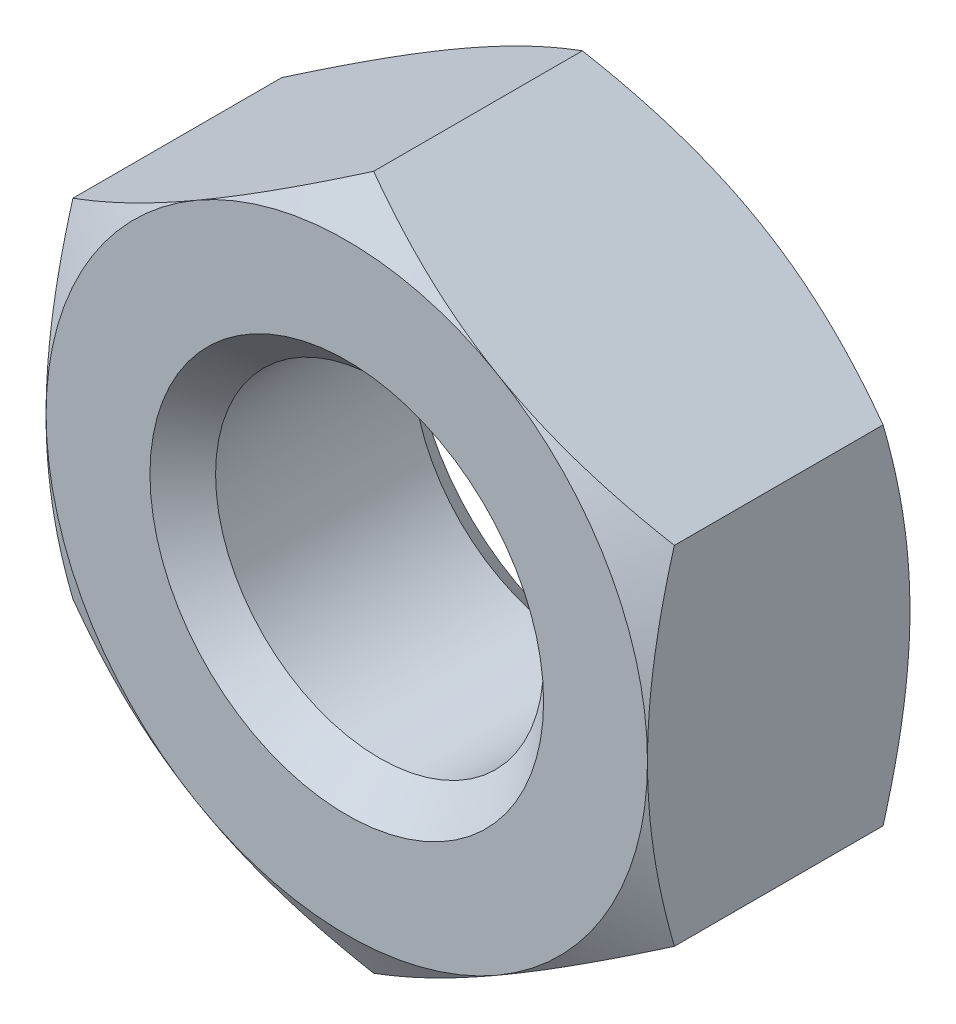
ISO-10303-21;
HEADER;
FILE_DESCRIPTION(('STEP AP214'),'2;1');
FILE_NAME('part.step','',(''),(''),'','','');
FILE_SCHEMA(('AUTOMOTIVE_DESIGN { 1 0 10303 214 1 1 1 1 }'));
ENDSEC;
DATA;
#1=APPLICATION_CONTEXT('core data for automotive mechanical design processes');
#2=APPLICATION_PROTOCOL_DEFINITION('international standard','automotive_design',2000,#1);
#3=PRODUCT_CONTEXT('',#1,'mechanical');
#4=PRODUCT('Part','Part','',(#3));
#5=PRODUCT_RELATED_PRODUCT_CATEGORY('part','',(#4));
#6=PRODUCT_DEFINITION_FORMATION('','',#4);
#7=PRODUCT_DEFINITION_CONTEXT('part definition',#1,'design');
#8=PRODUCT_DEFINITION('design','',#6,#7);
#9=PRODUCT_DEFINITION_SHAPE('','',#8);
#10=(LENGTH_UNIT() NAMED_UNIT(*) SI_UNIT(.MILLI.,.METRE.));
#11=(NAMED_UNIT(*) PLANE_ANGLE_UNIT() SI_UNIT($,.RADIAN.));
#12=(NAMED_UNIT(*) SI_UNIT($,.STERADIAN.) SOLID_ANGLE_UNIT());
#13=UNCERTAINTY_MEASURE_WITH_UNIT(LENGTH_MEASURE(1.E-05),#10,'distance_accuracy_value','');
#14=(GEOMETRIC_REPRESENTATION_CONTEXT(3) GLOBAL_UNCERTAINTY_ASSIGNED_CONTEXT((#13)) GLOBAL_UNIT_ASSIGNED_CONTEXT((#10,
#11,#12)) REPRESENTATION_CONTEXT('',''));
#15=CARTESIAN_POINT('',(0.,0.,0.));
#16=DIRECTION('',(0.,0.,1.));
#17=DIRECTION('',(1.,0.,0.));
#18=AXIS2_PLACEMENT_3D('',#15,#16,#17);
#19=CARTESIAN_POINT('',(0.,0.,2.4));
#20=DIRECTION('',(0.,0.,-1.));
#21=DIRECTION('',(-1.,0.,0.));
#22=AXIS2_PLACEMENT_3D('',#19,#20,#21);
#23=CONICAL_SURFACE('',#22,2.74999999999999,1.0471975511966);
#24=CARTESIAN_POINT('',(-0.000200000000000651,3.17554195059678,2.15431323663524));
#25=CARTESIAN_POINT('',(0.120649220659905,3.10576962051743,2.19461233775073));
#26=CARTESIAN_POINT('',(0.242541602622633,3.03539502097908,2.23126309740233));
#27=CARTESIAN_POINT('',(0.488437126727893,2.89342717394439,2.2952378170302));
#28=CARTESIAN_POINT('',(0.612444638573856,2.82183140359858,2.3225391443255));
#29=CARTESIAN_POINT('',(0.858922797975944,2.67952717191843,2.36503825470588));
#30=CARTESIAN_POINT('',(0.981355518587418,2.60884060771577,2.38051888137754));
#31=CARTESIAN_POINT('',(1.22679714236892,2.46713482015519,2.39900060263006));
#32=CARTESIAN_POINT('',(1.34980515323291,2.39611611197038,2.4020170005374));
#33=CARTESIAN_POINT('',(1.57965878661079,2.26341005486544,2.39574685457145));
#34=CARTESIAN_POINT('',(1.68653879125402,2.20170285541369,2.38799984572329));
#35=CARTESIAN_POINT('',(1.89960246733475,2.07869048467395,2.36344481893564));
#36=CARTESIAN_POINT('',(2.00578540164889,2.01738573896434,2.34662841034943));
#37=CARTESIAN_POINT('',(2.21928848939318,1.89411967378235,2.30458807765404));
#38=CARTESIAN_POINT('',(2.32658161614285,1.83217395817123,2.27918591931277));
#39=CARTESIAN_POINT('',(2.53956747928405,1.70920651275308,2.22153277416001));
#40=CARTESIAN_POINT('',(2.64526294502665,1.64818320715446,2.18929533670101));
#41=CARTESIAN_POINT('',(2.7502,1.58759777021764,2.15431323663524));
#42=B_SPLINE_CURVE_WITH_KNOTS('',3,(#24,#25,#26,#27,#28,#29,#30,#31,#32,#33,#34,#35,#36,#37,#38,
#39,#40,#41),.UNSPECIFIED.,.F.,.F.,(4,2,2,2,2,2,2,2,4),(0.,0.435912828725888,0.872873557116333,
1.29901931904672,1.72464171213574,2.09526089052938,2.46622354066374,2.84541551798557,
3.22386274754524),.UNSPECIFIED.);
#43=CARTESIAN_POINT('',(0.,3.17542648054294,2.15437990693813));
#44=VERTEX_POINT('',#43);
#45=CARTESIAN_POINT('',(1.375,2.38156986040721,2.4));
#46=VERTEX_POINT('',#45);
#47=EDGE_CURVE('E291',#44,#46,#42,.T.);
#48=ORIENTED_EDGE('',*,*,#47,.F.);
#49=CARTESIAN_POINT('',(-2.7502,1.58759777021763,2.15431323663524));
#50=CARTESIAN_POINT('',(-2.62935077934009,1.65737010029699,2.19461233775073));
#51=CARTESIAN_POINT('',(-2.50745839737737,1.72774469983533,2.23126309740234));
#52=CARTESIAN_POINT('',(-2.26156287327211,1.86971254687003,2.2952378170302));
#53=CARTESIAN_POINT('',(-2.13755536142615,1.94130831721583,2.3225391443255));
#54=CARTESIAN_POINT('',(-1.89107720202406,2.08361254889599,2.36503825470588));
#55=CARTESIAN_POINT('',(-1.76864448141258,2.15429911309864,2.38051888137754));
#56=CARTESIAN_POINT('',(-1.52320285763108,2.29600490065923,2.39900060263006));
#57=CARTESIAN_POINT('',(-1.40019484676709,2.36702360884404,2.4020170005374));
#58=CARTESIAN_POINT('',(-1.17034121338921,2.49972966594897,2.39574685457145));
#59=CARTESIAN_POINT('',(-1.06346120874598,2.56143686540073,2.38799984572329));
#60=CARTESIAN_POINT('',(-0.85039753266525,2.68444923614047,2.36344481893564));
#61=CARTESIAN_POINT('',(-0.744214598351111,2.74575398185008,2.34662841034943));
#62=CARTESIAN_POINT('',(-0.530711510606816,2.86902004703206,2.30458807765404));
#63=CARTESIAN_POINT('',(-0.423418383857145,2.93096576264318,2.27918591931277));
#64=CARTESIAN_POINT('',(-0.210432520715949,3.05393320806134,2.22153277416002));
#65=CARTESIAN_POINT('',(-0.104737054973348,3.11495651365995,2.18929533670101));
#66=CARTESIAN_POINT('',(0.000199999999999467,3.17554195059678,2.15431323663524));
#67=B_SPLINE_CURVE_WITH_KNOTS('',3,(#49,#50,#51,#52,#53,#54,#55,#56,#57,#58,#59,#60,#61,#62,#63,
#64,#65,#66),.UNSPECIFIED.,.F.,.F.,(4,2,2,2,2,2,2,2,4),(0.,0.435912828725888,0.872873557116332,
1.29901931904672,1.72464171213574,2.09526089052938,2.46622354066374,2.84541551798557,
3.22386274754524),.UNSPECIFIED.);
#68=CARTESIAN_POINT('',(-1.375,2.3815698604072,2.4));
#69=VERTEX_POINT('',#68);
#70=EDGE_CURVE('E186',#69,#44,#67,.T.);
#71=ORIENTED_EDGE('',*,*,#70,.F.);
#72=CARTESIAN_POINT('',(0.,0.,2.4));
#73=DIRECTION('',(0.,0.,1.));
#74=DIRECTION('',(1.,0.,0.));
#75=AXIS2_PLACEMENT_3D('',#72,#73,#74);
#76=CIRCLE('',#75,2.74999999999999);
#77=EDGE_CURVE('E294',#46,#69,#76,.T.);
#78=ORIENTED_EDGE('',*,*,#77,.F.);
#79=EDGE_LOOP('',(#48,#71,#78));
#80=FACE_BOUND('',#79,.T.);
#81=ADVANCED_FACE('F35',(#80),#23,.T.);
#82=CARTESIAN_POINT('',(2.75,1.58771324027147,2.15437990693813));
#83=VERTEX_POINT('',#82);
#84=EDGE_CURVE('E229',#46,#83,#42,.T.);
#85=ORIENTED_EDGE('',*,*,#84,.F.);
#86=CARTESIAN_POINT('',(2.75,0.,2.4));
#87=VERTEX_POINT('',#86);
#88=EDGE_CURVE('E151',#87,#46,#76,.T.);
#89=ORIENTED_EDGE('',*,*,#88,.F.);
#90=CARTESIAN_POINT('',(2.75,-4.25703551985585,1.06168912227367));
#91=CARTESIAN_POINT('',(2.75,-4.13699202015188,1.1198897518569));
#92=CARTESIAN_POINT('',(2.75,-4.01667212109087,1.17753009028097));
#93=CARTESIAN_POINT('',(2.75,-3.77533251301454,1.29137491748593));
#94=CARTESIAN_POINT('',(2.75,-3.65431269665322,1.34757917844764));
#95=CARTESIAN_POINT('',(2.75,-3.41079896235313,1.45852101631478));
#96=CARTESIAN_POINT('',(2.75,-3.28830060104036,1.51324887399081));
#97=CARTESIAN_POINT('',(2.75,-3.0423268737957,1.6204546272455));
#98=CARTESIAN_POINT('',(2.75,-2.91885155457909,1.67293262964465));
#99=CARTESIAN_POINT('',(2.75,-2.6667672834933,1.77667422753005));
#100=CARTESIAN_POINT('',(2.75,-2.53812020933303,1.827845696476));
#101=CARTESIAN_POINT('',(2.75,-2.27931806738651,1.92629695293699));
#102=CARTESIAN_POINT('',(2.75,-2.14916283179932,1.97357630257118));
#103=CARTESIAN_POINT('',(2.75,-1.88738349367343,2.06299644494595));
#104=CARTESIAN_POINT('',(2.75,-1.75576300415808,2.10514770824627));
#105=CARTESIAN_POINT('',(2.75,-1.49063398759824,2.18295393254175));
#106=CARTESIAN_POINT('',(2.75,-1.35712607210049,2.21861094801352));
#107=CARTESIAN_POINT('',(2.75,-1.08888872336787,2.28152236978619));
#108=CARTESIAN_POINT('',(2.75,-0.954170144262174,2.30882220058641));
#109=CARTESIAN_POINT('',(2.75,-0.683065665460635,2.35347177013791));
#110=CARTESIAN_POINT('',(2.75,-0.546679921873346,2.3708224333215));
#111=CARTESIAN_POINT('',(2.75,-0.274700449305351,2.39396226102916));
#112=CARTESIAN_POINT('',(2.75,-0.139119628156501,2.39989941561687));
#113=CARTESIAN_POINT('',(2.75,0.132061490225183,2.40009796962967));
#114=CARTESIAN_POINT('',(2.75,0.267661787790451,2.39435913790454));
#115=CARTESIAN_POINT('',(2.75,0.498103730594134,2.37508940850493));
#116=CARTESIAN_POINT('',(2.75,0.593192954043431,2.3643496320825));
#117=CARTESIAN_POINT('',(2.75,0.782667924753957,2.33780156933777));
#118=CARTESIAN_POINT('',(2.75,0.877053573597802,2.32199258705082));
#119=CARTESIAN_POINT('',(2.75,1.1590214506406,2.26779109356569));
#120=CARTESIAN_POINT('',(2.75,1.34530708104592,2.22263420881916));
#121=CARTESIAN_POINT('',(2.75,1.71809932057939,2.11803227199905));
#122=CARTESIAN_POINT('',(2.75,1.9045206274722,2.05829473382884));
#123=CARTESIAN_POINT('',(2.75,2.18156676107034,1.96151978056661));
#124=CARTESIAN_POINT('',(2.75,2.27347486824372,1.92807062515835));
#125=CARTESIAN_POINT('',(2.75,2.45653326427404,1.85915907022219));
#126=CARTESIAN_POINT('',(2.75,2.547683561196,1.82369669215161));
#127=CARTESIAN_POINT('',(2.75,2.75939154686356,1.73907482926415));
#128=CARTESIAN_POINT('',(2.75,2.87969007423819,1.68926894777099));
#129=CARTESIAN_POINT('',(2.75,3.1192872521915,1.58730203505826));
#130=CARTESIAN_POINT('',(2.75,3.23858584929597,1.53514087882425));
#131=CARTESIAN_POINT('',(2.75,3.59527333595667,1.3758406288591));
#132=CARTESIAN_POINT('',(2.75,3.83141053240481,1.26590252071369));
#133=CARTESIAN_POINT('',(2.75,4.30155519589416,1.04103998359695));
#134=CARTESIAN_POINT('',(2.75,4.53556037022231,0.926110812679219));
#135=CARTESIAN_POINT('',(2.75,5.00188861456581,0.692877117459767));
#136=CARTESIAN_POINT('',(2.75,5.23421162460997,0.574572473553994));
#137=CARTESIAN_POINT('',(2.75,5.67871269594213,0.34531625854499));
#138=CARTESIAN_POINT('',(2.75,5.89098784504084,0.234552282947296));
#139=CARTESIAN_POINT('',(2.75,6.31474198142339,0.0114964607474494));
#140=CARTESIAN_POINT('',(2.75,6.52622094212367,-0.100795436302165));
#141=CARTESIAN_POINT('',(2.75,6.94804906666101,-0.32627676551508));
#142=CARTESIAN_POINT('',(2.75,7.15839972281913,-0.439463409992933));
#143=CARTESIAN_POINT('',(2.75,7.57858974341547,-0.666755674620288));
#144=CARTESIAN_POINT('',(2.75,7.78842913439936,-0.780861245673605));
#145=CARTESIAN_POINT('',(2.75,7.9980793794217,-0.895310882801251));
#146=B_SPLINE_CURVE_WITH_KNOTS('',3,(#90,#91,#92,#93,#94,#95,#96,#97,#98,#99,#100,#101,#102,
#103,#104,#105,#106,#107,#108,#109,#110,#111,#112,#113,#114,#115,#116,#117,#118,#119,#120,#121,
#122,#123,#124,#125,#126,#127,#128,#129,#130,#131,#132,#133,#134,#135,#136,#137,#138,#139,#140,
#141,#142,#143,#144,#145),.UNSPECIFIED.,.F.,.F.,(4,2,2,2,2,2,2,2,2,2,2,2,2,2,2,2,2,2,2,2,2,2,2,
2,2,2,2,4),(0.,0.400229610241993,0.800522323538853,1.20300748075733,1.60547350724249,
2.02077686084746,2.4361268742646,2.85061405973589,3.26496989220291,3.67703182770082,
4.08905547003323,4.49569970512682,4.90235199066004,5.18929513742869,5.47627769625907,
6.05056533161353,6.63748740454623,6.93088606817702,7.22428160529455,7.61485258544412,
8.00544432094012,8.7867683742183,9.568851728826,10.3509628297038,11.0692623230148,
11.7875855902848,12.5041914870438,13.2207593478582),.UNSPECIFIED.);
#147=EDGE_CURVE('E227',#83,#87,#146,.F.);
#148=ORIENTED_EDGE('',*,*,#147,.F.);
#149=EDGE_LOOP('',(#85,#89,#148));
#150=FACE_BOUND('',#149,.T.);
#151=ADVANCED_FACE('F282',(#150),#23,.T.);
#152=CARTESIAN_POINT('',(2.75,-1.58771324027147,2.15437990693813));
#153=VERTEX_POINT('',#152);
#154=EDGE_CURVE('E222',#87,#153,#146,.F.);
#155=ORIENTED_EDGE('',*,*,#154,.F.);
#156=CARTESIAN_POINT('',(1.375,-2.38156986040721,2.4));
#157=VERTEX_POINT('',#156);
#158=EDGE_CURVE('E297',#157,#87,#76,.T.);
#159=ORIENTED_EDGE('',*,*,#158,.F.);
#160=CARTESIAN_POINT('',(2.7502,-1.58759777021763,2.15431323663524));
#161=CARTESIAN_POINT('',(2.62935077934009,-1.65737010029699,2.19461233775073));
#162=CARTESIAN_POINT('',(2.50745839737737,-1.72774469983533,2.23126309740234));
#163=CARTESIAN_POINT('',(2.26156287327211,-1.86971254687003,2.2952378170302));
#164=CARTESIAN_POINT('',(2.13755536142615,-1.94130831721583,2.3225391443255));
#165=CARTESIAN_POINT('',(1.89107720202406,-2.08361254889599,2.36503825470588));
#166=CARTESIAN_POINT('',(1.76864448141258,-2.15429911309864,2.38051888137754));
#167=CARTESIAN_POINT('',(1.52320285763108,-2.29600490065923,2.39900060263006));
#168=CARTESIAN_POINT('',(1.40019484676709,-2.36702360884404,2.4020170005374));
#169=CARTESIAN_POINT('',(1.17034121338921,-2.49972966594897,2.39574685457145));
#170=CARTESIAN_POINT('',(1.06346120874598,-2.56143686540073,2.38799984572329));
#171=CARTESIAN_POINT('',(0.85039753266525,-2.68444923614047,2.36344481893564));
#172=CARTESIAN_POINT('',(0.744214598351111,-2.74575398185008,2.34662841034943));
#173=CARTESIAN_POINT('',(0.530711510606816,-2.86902004703206,2.30458807765404));
#174=CARTESIAN_POINT('',(0.423418383857145,-2.93096576264318,2.27918591931277));
#175=CARTESIAN_POINT('',(0.210432520715948,-3.05393320806134,2.22153277416002));
#176=CARTESIAN_POINT('',(0.104737054973347,-3.11495651365995,2.18929533670101));
#177=CARTESIAN_POINT('',(-0.000200000000000172,-3.17554195059678,2.15431323663524));
#178=B_SPLINE_CURVE_WITH_KNOTS('',3,(#160,#161,#162,#163,#164,#165,#166,#167,#168,#169,#170,
#171,#172,#173,#174,#175,#176,#177),.UNSPECIFIED.,.F.,.F.,(4,2,2,2,2,2,2,2,4),(0.,
0.435912828725888,0.872873557116332,1.29901931904672,1.72464171213574,2.09526089052938,
2.46622354066374,2.84541551798557,3.22386274754524),.UNSPECIFIED.);
#179=EDGE_CURVE('E228',#153,#157,#178,.T.);
#180=ORIENTED_EDGE('',*,*,#179,.F.);
#181=EDGE_LOOP('',(#155,#159,#180));
#182=FACE_BOUND('',#181,.T.);
#183=ADVANCED_FACE('F287',(#182),#23,.T.);
#184=CARTESIAN_POINT('',(0.,-3.17542648054294,2.15437990693813));
#185=VERTEX_POINT('',#184);
#186=EDGE_CURVE('E216',#157,#185,#178,.T.);
#187=ORIENTED_EDGE('',*,*,#186,.F.);
#188=CARTESIAN_POINT('',(-1.375,-2.38156986040721,2.4));
#189=VERTEX_POINT('',#188);
#190=EDGE_CURVE('E299',#189,#157,#76,.T.);
#191=ORIENTED_EDGE('',*,*,#190,.F.);
#192=CARTESIAN_POINT('',(0.0002,-3.17554195059678,2.15431323663524));
#193=CARTESIAN_POINT('',(-0.120649220659906,-3.10576962051743,2.19461233775073));
#194=CARTESIAN_POINT('',(-0.242541602622634,-3.03539502097908,2.23126309740233));
#195=CARTESIAN_POINT('',(-0.488437126727893,-2.89342717394439,2.2952378170302));
#196=CARTESIAN_POINT('',(-0.612444638573856,-2.82183140359858,2.3225391443255));
#197=CARTESIAN_POINT('',(-0.858922797975945,-2.67952717191843,2.36503825470588));
#198=CARTESIAN_POINT('',(-0.981355518587418,-2.60884060771577,2.38051888137754));
#199=CARTESIAN_POINT('',(-1.22679714236892,-2.46713482015519,2.39900060263006));
#200=CARTESIAN_POINT('',(-1.34980515323291,-2.39611611197038,2.4020170005374));
#201=CARTESIAN_POINT('',(-1.57965878661079,-2.26341005486544,2.39574685457145));
#202=CARTESIAN_POINT('',(-1.68653879125402,-2.20170285541369,2.38799984572329));
#203=CARTESIAN_POINT('',(-1.89960246733475,-2.07869048467395,2.36344481893564));
#204=CARTESIAN_POINT('',(-2.00578540164889,-2.01738573896434,2.34662841034943));
#205=CARTESIAN_POINT('',(-2.21928848939318,-1.89411967378235,2.30458807765404));
#206=CARTESIAN_POINT('',(-2.32658161614285,-1.83217395817123,2.27918591931277));
#207=CARTESIAN_POINT('',(-2.53956747928405,-1.70920651275308,2.22153277416002));
#208=CARTESIAN_POINT('',(-2.64526294502665,-1.64818320715446,2.18929533670101));
#209=CARTESIAN_POINT('',(-2.7502,-1.58759777021763,2.15431323663524));
#210=B_SPLINE_CURVE_WITH_KNOTS('',3,(#192,#193,#194,#195,#196,#197,#198,#199,#200,#201,#202,
#203,#204,#205,#206,#207,#208,#209),.UNSPECIFIED.,.F.,.F.,(4,2,2,2,2,2,2,2,4),(0.,
0.435912828725889,0.872873557116333,1.29901931904672,1.72464171213574,2.09526089052938,
2.46622354066374,2.84541551798557,3.22386274754524),.UNSPECIFIED.);
#211=EDGE_CURVE('E323',#185,#189,#210,.T.);
#212=ORIENTED_EDGE('',*,*,#211,.F.);
#213=EDGE_LOOP('',(#187,#191,#212));
#214=FACE_BOUND('',#213,.T.);
#215=ADVANCED_FACE('F327',(#214),#23,.T.);
#216=CARTESIAN_POINT('',(-2.75,-1.58771324027147,2.15437990693813));
#217=VERTEX_POINT('',#216);
#218=EDGE_CURVE('E211',#189,#217,#210,.T.);
#219=ORIENTED_EDGE('',*,*,#218,.F.);
#220=CARTESIAN_POINT('',(-2.75,0.,2.4));
#221=VERTEX_POINT('',#220);
#222=EDGE_CURVE('E314',#221,#189,#76,.T.);
#223=ORIENTED_EDGE('',*,*,#222,.F.);
#224=CARTESIAN_POINT('',(-2.75,-4.25703551985585,1.06168912227367));
#225=CARTESIAN_POINT('',(-2.75,-4.13699202015188,1.1198897518569));
#226=CARTESIAN_POINT('',(-2.75,-4.01667212109087,1.17753009028097));
#227=CARTESIAN_POINT('',(-2.75,-3.77533251301454,1.29137491748593));
#228=CARTESIAN_POINT('',(-2.75,-3.65431269665323,1.34757917844764));
#229=CARTESIAN_POINT('',(-2.75,-3.41079896235313,1.45852101631478));
#230=CARTESIAN_POINT('',(-2.75,-3.28830060104036,1.51324887399081));
#231=CARTESIAN_POINT('',(-2.75,-3.0423268737957,1.6204546272455));
#232=CARTESIAN_POINT('',(-2.75,-2.9188515545791,1.67293262964465));
#233=CARTESIAN_POINT('',(-2.75,-2.6667672834933,1.77667422753005));
#234=CARTESIAN_POINT('',(-2.75,-2.53812020933303,1.827845696476));
#235=CARTESIAN_POINT('',(-2.75,-2.27931806738651,1.92629695293699));
#236=CARTESIAN_POINT('',(-2.75,-2.14916283179932,1.97357630257118));
#237=CARTESIAN_POINT('',(-2.75,-1.88738349367343,2.06299644494595));
#238=CARTESIAN_POINT('',(-2.75,-1.75576300415808,2.10514770824627));
#239=CARTESIAN_POINT('',(-2.75,-1.49063398759824,2.18295393254175));
#240=CARTESIAN_POINT('',(-2.75,-1.35712607210049,2.21861094801352));
#241=CARTESIAN_POINT('',(-2.75,-1.08888872336787,2.28152236978619));
#242=CARTESIAN_POINT('',(-2.75,-0.954170144262176,2.30882220058641));
#243=CARTESIAN_POINT('',(-2.75,-0.683065665460636,2.35347177013791));
#244=CARTESIAN_POINT('',(-2.75,-0.546679921873348,2.3708224333215));
#245=CARTESIAN_POINT('',(-2.75,-0.274700449305353,2.39396226102916));
#246=CARTESIAN_POINT('',(-2.75,-0.139119628156503,2.39989941561687));
#247=CARTESIAN_POINT('',(-2.75,0.132061490225181,2.40009796962967));
#248=CARTESIAN_POINT('',(-2.75,0.267661787790449,2.39435913790454));
#249=CARTESIAN_POINT('',(-2.75,0.498103730594132,2.37508940850493));
#250=CARTESIAN_POINT('',(-2.75,0.593192954043429,2.3643496320825));
#251=CARTESIAN_POINT('',(-2.75,0.782667924753955,2.33780156933777));
#252=CARTESIAN_POINT('',(-2.75,0.8770535735978,2.32199258705082));
#253=CARTESIAN_POINT('',(-2.75,1.1590214506406,2.26779109356569));
#254=CARTESIAN_POINT('',(-2.75,1.34530708104592,2.22263420881916));
#255=CARTESIAN_POINT('',(-2.75,1.71809932057939,2.11803227199905));
#256=CARTESIAN_POINT('',(-2.75,1.9045206274722,2.05829473382884));
#257=CARTESIAN_POINT('',(-2.75,2.18156676107034,1.96151978056661));
#258=CARTESIAN_POINT('',(-2.75,2.27347486824371,1.92807062515835));
#259=CARTESIAN_POINT('',(-2.75,2.45653326427404,1.8591590702222));
#260=CARTESIAN_POINT('',(-2.75,2.547683561196,1.82369669215162));
#261=CARTESIAN_POINT('',(-2.75,2.75939154686356,1.73907482926416));
#262=CARTESIAN_POINT('',(-2.75,2.87969007423819,1.68926894777099));
#263=CARTESIAN_POINT('',(-2.75,3.1192872521915,1.58730203505826));
#264=CARTESIAN_POINT('',(-2.75,3.23858584929597,1.53514087882425));
#265=CARTESIAN_POINT('',(-2.75,3.59527333595667,1.37584062885911));
#266=CARTESIAN_POINT('',(-2.75,3.83141053240481,1.2659025207137));
#267=CARTESIAN_POINT('',(-2.75,4.30155519589415,1.04103998359695));
#268=CARTESIAN_POINT('',(-2.75,4.53556037022231,0.92611081267922));
#269=CARTESIAN_POINT('',(-2.75,5.00188861456581,0.692877117459767));
#270=CARTESIAN_POINT('',(-2.75,5.23421162460997,0.574572473553996));
#271=CARTESIAN_POINT('',(-2.75,5.67871269594213,0.345316258544992));
#272=CARTESIAN_POINT('',(-2.75,5.89098784504084,0.234552282947297));
#273=CARTESIAN_POINT('',(-2.75,6.31474198142338,0.0114964607474499));
#274=CARTESIAN_POINT('',(-2.75,6.52622094212367,-0.100795436302165));
#275=CARTESIAN_POINT('',(-2.75,6.94804906666101,-0.32627676551508));
#276=CARTESIAN_POINT('',(-2.75,7.15839972281913,-0.439463409992933));
#277=CARTESIAN_POINT('',(-2.75,7.57858974341547,-0.666755674620288));
#278=CARTESIAN_POINT('',(-2.75,7.78842913439936,-0.780861245673604));
#279=CARTESIAN_POINT('',(-2.75,7.9980793794217,-0.895310882801251));
#280=B_SPLINE_CURVE_WITH_KNOTS('',3,(#224,#225,#226,#227,#228,#229,#230,#231,#232,#233,#234,
#235,#236,#237,#238,#239,#240,#241,#242,#243,#244,#245,#246,#247,#248,#249,#250,#251,#252,#253,
#254,#255,#256,#257,#258,#259,#260,#261,#262,#263,#264,#265,#266,#267,#268,#269,#270,#271,#272,
#273,#274,#275,#276,#277,#278,#279),.UNSPECIFIED.,.F.,.F.,(4,2,2,2,2,2,2,2,2,2,2,2,2,2,2,2,2,2,
2,2,2,2,2,2,2,2,2,4),(0.,0.400229610241994,0.800522323538854,1.20300748075733,1.60547350724249,
2.02077686084746,2.4361268742646,2.85061405973589,3.26496989220292,3.67703182770082,
4.08905547003323,4.49569970512682,4.90235199066004,5.18929513742869,5.47627769625907,
6.05056533161353,6.63748740454623,6.93088606817702,7.22428160529455,7.61485258544412,
8.00544432094012,8.78676837421829,9.568851728826,10.3509628297038,11.0692623230148,
11.7875855902848,12.5041914870438,13.2207593478582),.UNSPECIFIED.);
#281=EDGE_CURVE('E319',#217,#221,#280,.T.);
#282=ORIENTED_EDGE('',*,*,#281,.F.);
#283=EDGE_LOOP('',(#219,#223,#282));
#284=FACE_BOUND('',#283,.T.);
#285=ADVANCED_FACE('F203',(#284),#23,.T.);
#286=CARTESIAN_POINT('',(0.,0.,0.577350269189626));
#287=DIRECTION('',(0.,0.,1.));
#288=DIRECTION('',(1.,0.,0.));
#289=AXIS2_PLACEMENT_3D('',#286,#287,#288);
#290=CONICAL_SURFACE('',#289,3.75,1.0471975511966);
#291=CARTESIAN_POINT('',(-0.000199999999999986,-3.17554195059678,0.245686763364763));
#292=CARTESIAN_POINT('',(0.120649220659906,-3.10576962051743,0.205387662249266));
#293=CARTESIAN_POINT('',(0.242541602622634,-3.03539502097908,0.168736902597664));
#294=CARTESIAN_POINT('',(0.488437126727893,-2.89342717394439,0.104762182969803));
#295=CARTESIAN_POINT('',(0.612444638573855,-2.82183140359858,0.0774608556745002));
#296=CARTESIAN_POINT('',(0.858922797975944,-2.67952717191842,0.0349617452941199));
#297=CARTESIAN_POINT('',(0.981355518587417,-2.60884060771577,0.0194811186224608));
#298=CARTESIAN_POINT('',(1.22679714236892,-2.46713482015519,0.000999397369943418));
#299=CARTESIAN_POINT('',(1.34980515323291,-2.39611611197038,-0.00201700053739743));
#300=CARTESIAN_POINT('',(1.57965878661079,-2.26341005486544,0.00425314542854946));
#301=CARTESIAN_POINT('',(1.68653879125402,-2.20170285541369,0.0120001542767051));
#302=CARTESIAN_POINT('',(1.89960246733475,-2.07869048467395,0.0365551810643575));
#303=CARTESIAN_POINT('',(2.00578540164889,-2.01738573896433,0.0533715896505729));
#304=CARTESIAN_POINT('',(2.21928848939318,-1.89411967378235,0.0954119223459588));
#305=CARTESIAN_POINT('',(2.32658161614285,-1.83217395817123,0.120814080687233));
#306=CARTESIAN_POINT('',(2.53956747928405,-1.70920651275308,0.178467225839985));
#307=CARTESIAN_POINT('',(2.64526294502665,-1.64818320715446,0.210704663298985));
#308=CARTESIAN_POINT('',(2.7502,-1.58759777021763,0.245686763364763));
#309=B_SPLINE_CURVE_WITH_KNOTS('',3,(#291,#292,#293,#294,#295,#296,#297,#298,#299,#300,#301,
#302,#303,#304,#305,#306,#307,#308),.UNSPECIFIED.,.F.,.F.,(4,2,2,2,2,2,2,2,4),(0.,
0.435912828725888,0.872873557116332,1.29901931904672,1.72464171213574,2.09526089052938,
2.46622354066374,2.84541551798557,3.22386274754524),.UNSPECIFIED.);
#310=CARTESIAN_POINT('',(0.,-3.17542648054294,0.245620093061865));
#311=VERTEX_POINT('',#310);
#312=CARTESIAN_POINT('',(1.375,-2.38156986040721,0.));
#313=VERTEX_POINT('',#312);
#314=EDGE_CURVE('E259',#311,#313,#309,.T.);
#315=ORIENTED_EDGE('',*,*,#314,.F.);
#316=CARTESIAN_POINT('',(-2.7502,-1.58759777021763,0.245686763364763));
#317=CARTESIAN_POINT('',(-2.62935077934009,-1.65737010029699,0.205387662249266));
#318=CARTESIAN_POINT('',(-2.50745839737737,-1.72774469983533,0.168736902597665));
#319=CARTESIAN_POINT('',(-2.26156287327211,-1.86971254687003,0.104762182969804));
#320=CARTESIAN_POINT('',(-2.13755536142614,-1.94130831721583,0.0774608556745004));
#321=CARTESIAN_POINT('',(-1.89107720202406,-2.08361254889599,0.03496174529412));
#322=CARTESIAN_POINT('',(-1.76864448141258,-2.15429911309864,0.019481118622461));
#323=CARTESIAN_POINT('',(-1.52320285763108,-2.29600490065923,0.000999397369943816));
#324=CARTESIAN_POINT('',(-1.40019484676709,-2.36702360884404,-0.00201700053739688));
#325=CARTESIAN_POINT('',(-1.17034121338921,-2.49972966594897,0.00425314542855008));
#326=CARTESIAN_POINT('',(-1.06346120874598,-2.56143686540073,0.0120001542767057));
#327=CARTESIAN_POINT('',(-0.85039753266525,-2.68444923614047,0.036555181064358));
#328=CARTESIAN_POINT('',(-0.74421459835111,-2.74575398185008,0.0533715896505736));
#329=CARTESIAN_POINT('',(-0.530711510606816,-2.86902004703206,0.0954119223459596));
#330=CARTESIAN_POINT('',(-0.423418383857145,-2.93096576264318,0.120814080687234));
#331=CARTESIAN_POINT('',(-0.210432520715949,-3.05393320806134,0.178467225839985));
#332=CARTESIAN_POINT('',(-0.104737054973348,-3.11495651365995,0.210704663298985));
#333=CARTESIAN_POINT('',(0.000199999999999495,-3.17554195059678,0.245686763364763));
#334=B_SPLINE_CURVE_WITH_KNOTS('',3,(#316,#317,#318,#319,#320,#321,#322,#323,#324,#325,#326,
#327,#328,#329,#330,#331,#332,#333),.UNSPECIFIED.,.F.,.F.,(4,2,2,2,2,2,2,2,4),(0.,
0.435912828725888,0.872873557116332,1.29901931904672,1.72464171213574,2.09526089052938,
2.46622354066374,2.84541551798557,3.22386274754524),.UNSPECIFIED.);
#335=CARTESIAN_POINT('',(-1.375,-2.38156986040721,0.));
#336=VERTEX_POINT('',#335);
#337=EDGE_CURVE('E260',#336,#311,#334,.T.);
#338=ORIENTED_EDGE('',*,*,#337,.F.);
#339=CARTESIAN_POINT('',(0.,0.,0.));
#340=DIRECTION('',(0.,0.,1.));
#341=DIRECTION('',(1.,0.,0.));
#342=AXIS2_PLACEMENT_3D('',#339,#340,#341);
#343=CIRCLE('',#342,2.74999999999999);
#344=EDGE_CURVE('E162',#313,#336,#343,.F.);
#345=ORIENTED_EDGE('',*,*,#344,.F.);
#346=EDGE_LOOP('',(#315,#338,#345));
#347=FACE_BOUND('',#346,.T.);
#348=ADVANCED_FACE('F358',(#347),#290,.T.);
#349=CARTESIAN_POINT('',(2.75,-1.58771324027147,0.245620093061865));
#350=VERTEX_POINT('',#349);
#351=EDGE_CURVE('E254',#313,#350,#309,.T.);
#352=ORIENTED_EDGE('',*,*,#351,.F.);
#353=CARTESIAN_POINT('',(2.75,0.,0.));
#354=VERTEX_POINT('',#353);
#355=EDGE_CURVE('E153',#354,#313,#343,.F.);
#356=ORIENTED_EDGE('',*,*,#355,.F.);
#357=CARTESIAN_POINT('',(2.75,-4.25703551985585,1.33831087772632));
#358=CARTESIAN_POINT('',(2.75,-4.13699202015188,1.2801102481431));
#359=CARTESIAN_POINT('',(2.75,-4.01667212109087,1.22246990971903));
#360=CARTESIAN_POINT('',(2.75,-3.77533251301454,1.10862508251407));
#361=CARTESIAN_POINT('',(2.75,-3.65431269665322,1.05242082155236));
#362=CARTESIAN_POINT('',(2.75,-3.41079896235313,0.941478983685216));
#363=CARTESIAN_POINT('',(2.75,-3.28830060104036,0.88675112600919));
#364=CARTESIAN_POINT('',(2.75,-3.0423268737957,0.779545372754502));
#365=CARTESIAN_POINT('',(2.75,-2.91885155457909,0.727067370355354));
#366=CARTESIAN_POINT('',(2.75,-2.6667672834933,0.623325772469948));
#367=CARTESIAN_POINT('',(2.75,-2.53812020933303,0.572154303523997));
#368=CARTESIAN_POINT('',(2.75,-2.27931806738651,0.473703047063013));
#369=CARTESIAN_POINT('',(2.75,-2.14916283179931,0.426423697428816));
#370=CARTESIAN_POINT('',(2.75,-1.88738349367343,0.337003555054048));
#371=CARTESIAN_POINT('',(2.75,-1.75576300415808,0.294852291753733));
#372=CARTESIAN_POINT('',(2.75,-1.49063398759823,0.217046067458245));
#373=CARTESIAN_POINT('',(2.75,-1.35712607210049,0.181389051986483));
#374=CARTESIAN_POINT('',(2.75,-1.08888872336787,0.118477630213812));
#375=CARTESIAN_POINT('',(2.75,-0.954170144262174,0.0911777994135868));
#376=CARTESIAN_POINT('',(2.75,-0.683065665460635,0.0465282298620896));
#377=CARTESIAN_POINT('',(2.75,-0.546679921873346,0.0291775666784953));
#378=CARTESIAN_POINT('',(2.75,-0.274700449305351,0.00603773897083752));
#379=CARTESIAN_POINT('',(2.75,-0.139119628156501,0.000100584383132819));
#380=CARTESIAN_POINT('',(2.75,0.132061490225183,-9.79696296721715E-05));
#381=CARTESIAN_POINT('',(2.75,0.267661787790451,0.00564086209545714));
#382=CARTESIAN_POINT('',(2.75,0.498103730594134,0.0249105914950664));
#383=CARTESIAN_POINT('',(2.75,0.593192954043431,0.0356503679175002));
#384=CARTESIAN_POINT('',(2.75,0.782667924753957,0.0621984306622313));
#385=CARTESIAN_POINT('',(2.75,0.877053573597803,0.0780074129491808));
#386=CARTESIAN_POINT('',(2.75,1.1590214506406,0.132208906434314));
#387=CARTESIAN_POINT('',(2.75,1.34530708104592,0.177365791180839));
#388=CARTESIAN_POINT('',(2.75,1.71809932057939,0.281967728000949));
#389=CARTESIAN_POINT('',(2.75,1.90452062747221,0.341705266171157));
#390=CARTESIAN_POINT('',(2.75,2.18156676107034,0.438480219433393));
#391=CARTESIAN_POINT('',(2.75,2.27347486824372,0.47192937484165));
#392=CARTESIAN_POINT('',(2.75,2.45653326427404,0.540840929777805));
#393=CARTESIAN_POINT('',(2.75,2.54768356119601,0.576303307848385));
#394=CARTESIAN_POINT('',(2.75,2.75939154686357,0.660925170735846));
#395=CARTESIAN_POINT('',(2.75,2.8796900742382,0.710731052229012));
#396=CARTESIAN_POINT('',(2.75,3.11928725219151,0.812697964941742));
#397=CARTESIAN_POINT('',(2.75,3.23858584929598,0.864859121175751));
#398=CARTESIAN_POINT('',(2.75,3.59527333595668,1.0241593711409));
#399=CARTESIAN_POINT('',(2.75,3.83141053240482,1.13409747928631));
#400=CARTESIAN_POINT('',(2.75,4.30155519589416,1.35896001640305));
#401=CARTESIAN_POINT('',(2.75,4.53556037022231,1.47388918732078));
#402=CARTESIAN_POINT('',(2.75,5.00188861456582,1.70712288254023));
#403=CARTESIAN_POINT('',(2.75,5.23421162460998,1.82542752644601));
#404=CARTESIAN_POINT('',(2.75,5.67871269594213,2.05468374145501));
#405=CARTESIAN_POINT('',(2.75,5.89098784504084,2.1654477170527));
#406=CARTESIAN_POINT('',(2.75,6.31474198142339,2.38850353925255));
#407=CARTESIAN_POINT('',(2.75,6.52622094212367,2.50079543630216));
#408=CARTESIAN_POINT('',(2.75,6.94804906666101,2.72627676551508));
#409=CARTESIAN_POINT('',(2.75,7.15839972281914,2.83946340999293));
#410=CARTESIAN_POINT('',(2.75,7.57858974341547,3.06675567462029));
#411=CARTESIAN_POINT('',(2.75,7.78842913439937,3.1808612456736));
#412=CARTESIAN_POINT('',(2.75,7.9980793794217,3.29531088280125));
#413=B_SPLINE_CURVE_WITH_KNOTS('',3,(#357,#358,#359,#360,#361,#362,#363,#364,#365,#366,#367,
#368,#369,#370,#371,#372,#373,#374,#375,#376,#377,#378,#379,#380,#381,#382,#383,#384,#385,#386,
#387,#388,#389,#390,#391,#392,#393,#394,#395,#396,#397,#398,#399,#400,#401,#402,#403,#404,#405,
#406,#407,#408,#409,#410,#411,#412),.UNSPECIFIED.,.F.,.F.,(4,2,2,2,2,2,2,2,2,2,2,2,2,2,2,2,2,2,
2,2,2,2,2,2,2,2,2,4),(0.,0.400229610241994,0.800522323538853,1.20300748075733,1.60547350724249,
2.02077686084746,2.4361268742646,2.85061405973589,3.26496989220291,3.67703182770082,
4.08905547003323,4.49569970512682,4.90235199066003,5.18929513742868,5.47627769625907,
6.05056533161353,6.63748740454623,6.93088606817702,7.22428160529455,7.61485258544413,
8.00544432094013,8.7867683742183,9.568851728826,10.3509628297038,11.0692623230148,
11.7875855902848,12.5041914870438,13.2207593478582),.UNSPECIFIED.);
#414=EDGE_CURVE('E249',#350,#354,#413,.T.);
#415=ORIENTED_EDGE('',*,*,#414,.F.);
#416=EDGE_LOOP('',(#352,#356,#415));
#417=FACE_BOUND('',#416,.T.);
#418=ADVANCED_FACE('F353',(#417),#290,.T.);
#419=CARTESIAN_POINT('',(2.75,1.58771324027147,0.245620093061865));
#420=VERTEX_POINT('',#419);
#421=EDGE_CURVE('E147',#354,#420,#413,.T.);
#422=ORIENTED_EDGE('',*,*,#421,.F.);
#423=CARTESIAN_POINT('',(1.375,2.38156986040721,0.));
#424=VERTEX_POINT('',#423);
#425=EDGE_CURVE('E145',#424,#354,#343,.F.);
#426=ORIENTED_EDGE('',*,*,#425,.F.);
#427=CARTESIAN_POINT('',(2.7502,1.58759777021764,0.245686763364763));
#428=CARTESIAN_POINT('',(2.62935077934009,1.65737010029699,0.205387662249266));
#429=CARTESIAN_POINT('',(2.50745839737737,1.72774469983533,0.168736902597665));
#430=CARTESIAN_POINT('',(2.26156287327211,1.86971254687003,0.104762182969804));
#431=CARTESIAN_POINT('',(2.13755536142614,1.94130831721583,0.0774608556745004));
#432=CARTESIAN_POINT('',(1.89107720202406,2.08361254889599,0.03496174529412));
#433=CARTESIAN_POINT('',(1.76864448141258,2.15429911309864,0.0194811186224612));
#434=CARTESIAN_POINT('',(1.52320285763108,2.29600490065923,0.000999397369943997));
#435=CARTESIAN_POINT('',(1.40019484676709,2.36702360884404,-0.00201700053739685));
#436=CARTESIAN_POINT('',(1.17034121338921,2.49972966594897,0.00425314542855001));
#437=CARTESIAN_POINT('',(1.06346120874598,2.56143686540073,0.0120001542767056));
#438=CARTESIAN_POINT('',(0.85039753266525,2.68444923614047,0.0365551810643579));
#439=CARTESIAN_POINT('',(0.74421459835111,2.74575398185008,0.0533715896505734));
#440=CARTESIAN_POINT('',(0.530711510606816,2.86902004703206,0.0954119223459592));
#441=CARTESIAN_POINT('',(0.423418383857145,2.93096576264318,0.120814080687234));
#442=CARTESIAN_POINT('',(0.210432520715948,3.05393320806134,0.178467225839984));
#443=CARTESIAN_POINT('',(0.104737054973347,3.11495651365995,0.210704663298985));
#444=CARTESIAN_POINT('',(-0.000200000000000679,3.17554195059678,0.245686763364763));
#445=B_SPLINE_CURVE_WITH_KNOTS('',3,(#427,#428,#429,#430,#431,#432,#433,#434,#435,#436,#437,
#438,#439,#440,#441,#442,#443,#444),.UNSPECIFIED.,.F.,.F.,(4,2,2,2,2,2,2,2,4),(0.,
0.435912828725889,0.872873557116332,1.29901931904672,1.72464171213574,2.09526089052938,
2.46622354066374,2.84541551798557,3.22386274754524),.UNSPECIFIED.);
#446=EDGE_CURVE('E125',#420,#424,#445,.T.);
#447=ORIENTED_EDGE('',*,*,#446,.F.);
#448=EDGE_LOOP('',(#422,#426,#447));
#449=FACE_BOUND('',#448,.T.);
#450=ADVANCED_FACE('F146',(#449),#290,.T.);
#451=CARTESIAN_POINT('',(-2.75,-1.58771324027147,0.245620093061865));
#452=VERTEX_POINT('',#451);
#453=EDGE_CURVE('E250',#452,#336,#334,.T.);
#454=ORIENTED_EDGE('',*,*,#453,.F.);
#455=CARTESIAN_POINT('',(-2.75,-4.25703551985585,1.33831087772632));
#456=CARTESIAN_POINT('',(-2.75,-4.13699202015188,1.2801102481431));
#457=CARTESIAN_POINT('',(-2.75,-4.01667212109087,1.22246990971903));
#458=CARTESIAN_POINT('',(-2.75,-3.77533251301454,1.10862508251407));
#459=CARTESIAN_POINT('',(-2.75,-3.65431269665323,1.05242082155236));
#460=CARTESIAN_POINT('',(-2.75,-3.41079896235313,0.941478983685217));
#461=CARTESIAN_POINT('',(-2.75,-3.28830060104036,0.88675112600919));
#462=CARTESIAN_POINT('',(-2.75,-3.0423268737957,0.779545372754501));
#463=CARTESIAN_POINT('',(-2.75,-2.9188515545791,0.727067370355353));
#464=CARTESIAN_POINT('',(-2.75,-2.6667672834933,0.623325772469947));
#465=CARTESIAN_POINT('',(-2.75,-2.53812020933303,0.572154303523998));
#466=CARTESIAN_POINT('',(-2.75,-2.27931806738651,0.473703047063013));
#467=CARTESIAN_POINT('',(-2.75,-2.14916283179932,0.426423697428816));
#468=CARTESIAN_POINT('',(-2.75,-1.88738349367343,0.337003555054049));
#469=CARTESIAN_POINT('',(-2.75,-1.75576300415808,0.294852291753734));
#470=CARTESIAN_POINT('',(-2.75,-1.49063398759824,0.217046067458245));
#471=CARTESIAN_POINT('',(-2.75,-1.35712607210049,0.181389051986484));
#472=CARTESIAN_POINT('',(-2.75,-1.08888872336787,0.118477630213812));
#473=CARTESIAN_POINT('',(-2.75,-0.954170144262177,0.0911777994135868));
#474=CARTESIAN_POINT('',(-2.75,-0.683065665460638,0.0465282298620896));
#475=CARTESIAN_POINT('',(-2.75,-0.546679921873349,0.0291775666784952));
#476=CARTESIAN_POINT('',(-2.75,-0.274700449305354,0.00603773897083734));
#477=CARTESIAN_POINT('',(-2.75,-0.139119628156504,0.000100584383132603));
#478=CARTESIAN_POINT('',(-2.75,0.13206149022518,-9.79696296725427E-05));
#479=CARTESIAN_POINT('',(-2.75,0.267661787790448,0.00564086209545665));
#480=CARTESIAN_POINT('',(-2.75,0.498103730594131,0.024910591495066));
#481=CARTESIAN_POINT('',(-2.75,0.593192954043428,0.0356503679175));
#482=CARTESIAN_POINT('',(-2.75,0.782667924753954,0.0621984306622311));
#483=CARTESIAN_POINT('',(-2.75,0.877053573597799,0.0780074129491805));
#484=CARTESIAN_POINT('',(-2.75,1.1590214506406,0.132208906434313));
#485=CARTESIAN_POINT('',(-2.75,1.34530708104592,0.177365791180838));
#486=CARTESIAN_POINT('',(-2.75,1.71809932057939,0.281967728000949));
#487=CARTESIAN_POINT('',(-2.75,1.9045206274722,0.341705266171157));
#488=CARTESIAN_POINT('',(-2.75,2.18156676107034,0.438480219433392));
#489=CARTESIAN_POINT('',(-2.75,2.27347486824372,0.471929374841648));
#490=CARTESIAN_POINT('',(-2.75,2.45653326427404,0.540840929777804));
#491=CARTESIAN_POINT('',(-2.75,2.547683561196,0.576303307848384));
#492=CARTESIAN_POINT('',(-2.75,2.75939154686356,0.660925170735845));
#493=CARTESIAN_POINT('',(-2.75,2.87969007423819,0.710731052229011));
#494=CARTESIAN_POINT('',(-2.75,3.1192872521915,0.812697964941741));
#495=CARTESIAN_POINT('',(-2.75,3.23858584929597,0.86485912117575));
#496=CARTESIAN_POINT('',(-2.75,3.59527333595667,1.02415937114089));
#497=CARTESIAN_POINT('',(-2.75,3.83141053240481,1.1340974792863));
#498=CARTESIAN_POINT('',(-2.75,4.30155519589415,1.35896001640305));
#499=CARTESIAN_POINT('',(-2.75,4.53556037022231,1.47388918732078));
#500=CARTESIAN_POINT('',(-2.75,5.00188861456581,1.70712288254023));
#501=CARTESIAN_POINT('',(-2.75,5.23421162460997,1.825427526446));
#502=CARTESIAN_POINT('',(-2.75,5.67871269594213,2.05468374145501));
#503=CARTESIAN_POINT('',(-2.75,5.89098784504084,2.1654477170527));
#504=CARTESIAN_POINT('',(-2.75,6.31474198142338,2.38850353925255));
#505=CARTESIAN_POINT('',(-2.75,6.52622094212367,2.50079543630216));
#506=CARTESIAN_POINT('',(-2.75,6.94804906666101,2.72627676551508));
#507=CARTESIAN_POINT('',(-2.75,7.15839972281913,2.83946340999293));
#508=CARTESIAN_POINT('',(-2.75,7.57858974341547,3.06675567462029));
#509=CARTESIAN_POINT('',(-2.75,7.78842913439936,3.1808612456736));
#510=CARTESIAN_POINT('',(-2.75,7.9980793794217,3.29531088280125));
#511=B_SPLINE_CURVE_WITH_KNOTS('',3,(#455,#456,#457,#458,#459,#460,#461,#462,#463,#464,#465,
#466,#467,#468,#469,#470,#471,#472,#473,#474,#475,#476,#477,#478,#479,#480,#481,#482,#483,#484,
#485,#486,#487,#488,#489,#490,#491,#492,#493,#494,#495,#496,#497,#498,#499,#500,#501,#502,#503,
#504,#505,#506,#507,#508,#509,#510),.UNSPECIFIED.,.F.,.F.,(4,2,2,2,2,2,2,2,2,2,2,2,2,2,2,2,2,2,
2,2,2,2,2,2,2,2,2,4),(0.,0.400229610241993,0.800522323538853,1.20300748075733,1.60547350724249,
2.02077686084746,2.4361268742646,2.85061405973589,3.26496989220291,3.67703182770082,
4.08905547003323,4.49569970512682,4.90235199066004,5.18929513742869,5.47627769625907,
6.05056533161353,6.63748740454624,6.93088606817702,7.22428160529455,7.61485258544413,
8.00544432094013,8.7867683742183,9.568851728826,10.3509628297038,11.0692623230148,
11.7875855902848,12.5041914870438,13.2207593478582),.UNSPECIFIED.);
#512=CARTESIAN_POINT('',(-2.75,0.,0.));
#513=VERTEX_POINT('',#512);
#514=EDGE_CURVE('E135',#513,#452,#511,.F.);
#515=ORIENTED_EDGE('',*,*,#514,.F.);
#516=EDGE_CURVE('E158',#336,#513,#343,.F.);
#517=ORIENTED_EDGE('',*,*,#516,.F.);
#518=EDGE_LOOP('',(#454,#515,#517));
#519=FACE_BOUND('',#518,.T.);
#520=ADVANCED_FACE('F360',(#519),#290,.T.);
#521=CARTESIAN_POINT('',(0.,3.17542648054294,0.245620093061865));
#522=VERTEX_POINT('',#521);
#523=EDGE_CURVE('E129',#424,#522,#445,.T.);
#524=ORIENTED_EDGE('',*,*,#523,.F.);
#525=CARTESIAN_POINT('',(-1.375,2.3815698604072,0.));
#526=VERTEX_POINT('',#525);
#527=EDGE_CURVE('E141',#526,#424,#343,.F.);
#528=ORIENTED_EDGE('',*,*,#527,.F.);
#529=CARTESIAN_POINT('',(0.000199999999999349,3.17554195059678,0.245686763364763));
#530=CARTESIAN_POINT('',(-0.120649220659907,3.10576962051743,0.205387662249266));
#531=CARTESIAN_POINT('',(-0.242541602622635,3.03539502097908,0.168736902597665));
#532=CARTESIAN_POINT('',(-0.488437126727894,2.89342717394439,0.104762182969804));
#533=CARTESIAN_POINT('',(-0.612444638573856,2.82183140359858,0.0774608556745002));
#534=CARTESIAN_POINT('',(-0.858922797975945,2.67952717191842,0.0349617452941197));
#535=CARTESIAN_POINT('',(-0.981355518587418,2.60884060771577,0.0194811186224606));
#536=CARTESIAN_POINT('',(-1.22679714236892,2.46713482015518,0.000999397369943245));
#537=CARTESIAN_POINT('',(-1.34980515323291,2.39611611197038,-0.00201700053739748));
#538=CARTESIAN_POINT('',(-1.57965878661079,2.26341005486544,0.00425314542854956));
#539=CARTESIAN_POINT('',(-1.68653879125402,2.20170285541369,0.0120001542767052));
#540=CARTESIAN_POINT('',(-1.89960246733475,2.07869048467395,0.0365551810643576));
#541=CARTESIAN_POINT('',(-2.00578540164889,2.01738573896433,0.053371589650573));
#542=CARTESIAN_POINT('',(-2.21928848939318,1.89411967378235,0.095411922345959));
#543=CARTESIAN_POINT('',(-2.32658161614286,1.83217395817123,0.120814080687234));
#544=CARTESIAN_POINT('',(-2.53956747928405,1.70920651275308,0.178467225839985));
#545=CARTESIAN_POINT('',(-2.64526294502665,1.64818320715446,0.210704663298985));
#546=CARTESIAN_POINT('',(-2.7502,1.58759777021763,0.245686763364763));
#547=B_SPLINE_CURVE_WITH_KNOTS('',3,(#529,#530,#531,#532,#533,#534,#535,#536,#537,#538,#539,
#540,#541,#542,#543,#544,#545,#546),.UNSPECIFIED.,.F.,.F.,(4,2,2,2,2,2,2,2,4),(0.,
0.435912828725889,0.872873557116332,1.29901931904672,1.72464171213574,2.09526089052938,
2.46622354066374,2.84541551798557,3.22386274754524),.UNSPECIFIED.);
#548=EDGE_CURVE('E57',#522,#526,#547,.T.);
#549=ORIENTED_EDGE('',*,*,#548,.F.);
#550=EDGE_LOOP('',(#524,#528,#549));
#551=FACE_BOUND('',#550,.T.);
#552=ADVANCED_FACE('F139',(#551),#290,.T.);
#553=CARTESIAN_POINT('',(0.,0.,2.4));
#554=DIRECTION('',(0.,0.,-1.));
#555=DIRECTION('',(-1.,0.,0.));
#556=AXIS2_PLACEMENT_3D('',#553,#554,#555);
#557=CYLINDRICAL_SURFACE('',#556,1.5);
#558=CARTESIAN_POINT('',(0.,0.,0.300000000000001));
#559=DIRECTION('',(0.,0.,1.));
#560=DIRECTION('',(1.,0.,0.));
#561=AXIS2_PLACEMENT_3D('',#558,#559,#560);
#562=CIRCLE('',#561,1.5);
#563=CARTESIAN_POINT('',(1.5,0.,0.300000000000001));
#564=VERTEX_POINT('',#563);
#565=EDGE_CURVE('E43',#564,#564,#562,.F.);
#566=ORIENTED_EDGE('',*,*,#565,.T.);
#567=EDGE_LOOP('',(#566));
#568=FACE_BOUND('',#567,.T.);
#569=CARTESIAN_POINT('',(0.,0.,2.1));
#570=DIRECTION('',(0.,0.,1.));
#571=DIRECTION('',(1.,0.,0.));
#572=AXIS2_PLACEMENT_3D('',#569,#570,#571);
#573=CIRCLE('',#572,1.5);
#574=CARTESIAN_POINT('',(1.5,0.,2.1));
#575=VERTEX_POINT('',#574);
#576=EDGE_CURVE('E264',#575,#575,#573,.T.);
#577=ORIENTED_EDGE('',*,*,#576,.T.);
#578=EDGE_LOOP('',(#577));
#579=FACE_BOUND('',#578,.T.);
#580=ADVANCED_FACE('F204',(#568,#579),#557,.F.);
#581=CARTESIAN_POINT('',(0.,0.,2.4));
#582=DIRECTION('',(0.,0.,1.));
#583=DIRECTION('',(1.,0.,0.));
#584=AXIS2_PLACEMENT_3D('',#581,#582,#583);
#585=PLANE('',#584);
#586=CARTESIAN_POINT('',(0.,0.,2.4));
#587=DIRECTION('',(0.,0.,1.));
#588=DIRECTION('',(1.,0.,0.));
#589=AXIS2_PLACEMENT_3D('',#586,#587,#588);
#590=CIRCLE('',#589,1.8);
#591=CARTESIAN_POINT('',(1.8,0.,2.4));
#592=VERTEX_POINT('',#591);
#593=EDGE_CURVE('E11',#592,#592,#590,.F.);
#594=ORIENTED_EDGE('',*,*,#593,.T.);
#595=EDGE_LOOP('',(#594));
#596=FACE_BOUND('',#595,.T.);
#597=ORIENTED_EDGE('',*,*,#88,.T.);
#598=ORIENTED_EDGE('',*,*,#77,.T.);
#599=EDGE_CURVE('E312',#69,#221,#76,.T.);
#600=ORIENTED_EDGE('',*,*,#599,.T.);
#601=ORIENTED_EDGE('',*,*,#222,.T.);
#602=ORIENTED_EDGE('',*,*,#190,.T.);
#603=ORIENTED_EDGE('',*,*,#158,.T.);
#604=EDGE_LOOP('',(#597,#598,#600,#601,#602,#603));
#605=FACE_BOUND('',#604,.T.);
#606=ADVANCED_FACE('F276',(#596,#605),#585,.T.);
#607=CARTESIAN_POINT('',(0.,0.,0.));
#608=DIRECTION('',(0.,0.,1.));
#609=DIRECTION('',(1.,0.,0.));
#610=AXIS2_PLACEMENT_3D('',#607,#608,#609);
#611=PLANE('',#610);
#612=CARTESIAN_POINT('',(0.,0.,0.));
#613=DIRECTION('',(0.,0.,1.));
#614=DIRECTION('',(1.,0.,0.));
#615=AXIS2_PLACEMENT_3D('',#612,#613,#614);
#616=CIRCLE('',#615,1.8);
#617=CARTESIAN_POINT('',(1.8,0.,0.));
#618=VERTEX_POINT('',#617);
#619=EDGE_CURVE('E261',#618,#618,#616,.T.);
#620=ORIENTED_EDGE('',*,*,#619,.T.);
#621=EDGE_LOOP('',(#620));
#622=FACE_BOUND('',#621,.T.);
#623=ORIENTED_EDGE('',*,*,#355,.T.);
#624=ORIENTED_EDGE('',*,*,#344,.T.);
#625=ORIENTED_EDGE('',*,*,#516,.T.);
#626=EDGE_CURVE('E157',#513,#526,#343,.F.);
#627=ORIENTED_EDGE('',*,*,#626,.T.);
#628=ORIENTED_EDGE('',*,*,#527,.T.);
#629=ORIENTED_EDGE('',*,*,#425,.T.);
#630=EDGE_LOOP('',(#623,#624,#625,#627,#628,#629));
#631=FACE_BOUND('',#630,.T.);
#632=ADVANCED_FACE('F154',(#622,#631),#611,.F.);
#633=CARTESIAN_POINT('',(-2.75,1.58771324027147,2.15437990693813));
#634=VERTEX_POINT('',#633);
#635=EDGE_CURVE('E193',#221,#634,#280,.T.);
#636=ORIENTED_EDGE('',*,*,#635,.F.);
#637=ORIENTED_EDGE('',*,*,#599,.F.);
#638=EDGE_CURVE('E50',#634,#69,#67,.T.);
#639=ORIENTED_EDGE('',*,*,#638,.F.);
#640=EDGE_LOOP('',(#636,#637,#639));
#641=FACE_BOUND('',#640,.T.);
#642=ADVANCED_FACE('F198',(#641),#23,.T.);
#643=CARTESIAN_POINT('',(-2.75,1.58771324027147,0.245620093061865));
#644=VERTEX_POINT('',#643);
#645=EDGE_CURVE('E143',#644,#513,#511,.F.);
#646=ORIENTED_EDGE('',*,*,#645,.F.);
#647=EDGE_CURVE('E161',#526,#644,#547,.T.);
#648=ORIENTED_EDGE('',*,*,#647,.F.);
#649=ORIENTED_EDGE('',*,*,#626,.F.);
#650=EDGE_LOOP('',(#646,#648,#649));
#651=FACE_BOUND('',#650,.T.);
#652=ADVANCED_FACE('F174',(#651),#290,.T.);
#653=CARTESIAN_POINT('',(1.375,2.38156986040721,2.4));
#654=DIRECTION('',(-0.5,-0.866025403784439,0.));
#655=DIRECTION('',(0.866025403784439,-0.5,0.));
#656=AXIS2_PLACEMENT_3D('',#653,#654,#655);
#657=PLANE('',#656);
#658=ORIENTED_EDGE('',*,*,#47,.T.);
#659=ORIENTED_EDGE('',*,*,#84,.T.);
#660=DIRECTION('',(0.,0.,-1.));
#661=VECTOR('',#660,1.);
#662=CARTESIAN_POINT('',(2.75,1.58771324027147,2.4));
#663=LINE('',#662,#661);
#664=EDGE_CURVE('E131',#83,#420,#663,.T.);
#665=ORIENTED_EDGE('',*,*,#664,.T.);
#666=ORIENTED_EDGE('',*,*,#446,.T.);
#667=ORIENTED_EDGE('',*,*,#523,.T.);
#668=DIRECTION('',(0.,0.,-1.));
#669=VECTOR('',#668,1.);
#670=CARTESIAN_POINT('',(0.,3.17542648054294,2.4));
#671=LINE('',#670,#669);
#672=EDGE_CURVE('E343',#44,#522,#671,.T.);
#673=ORIENTED_EDGE('',*,*,#672,.F.);
#674=EDGE_LOOP('',(#658,#659,#665,#666,#667,#673));
#675=FACE_BOUND('',#674,.T.);
#676=ADVANCED_FACE('F127',(#675),#657,.F.);
#677=CARTESIAN_POINT('',(2.75,0.,2.4));
#678=DIRECTION('',(-1.,0.,0.));
#679=DIRECTION('',(0.,-1.,0.));
#680=AXIS2_PLACEMENT_3D('',#677,#678,#679);
#681=PLANE('',#680);
#682=ORIENTED_EDGE('',*,*,#147,.T.);
#683=ORIENTED_EDGE('',*,*,#154,.T.);
#684=DIRECTION('',(0.,0.,-1.));
#685=VECTOR('',#684,1.);
#686=CARTESIAN_POINT('',(2.75,-1.58771324027147,2.4));
#687=LINE('',#686,#685);
#688=EDGE_CURVE('E335',#153,#350,#687,.T.);
#689=ORIENTED_EDGE('',*,*,#688,.T.);
#690=ORIENTED_EDGE('',*,*,#414,.T.);
#691=ORIENTED_EDGE('',*,*,#421,.T.);
#692=ORIENTED_EDGE('',*,*,#664,.F.);
#693=EDGE_LOOP('',(#682,#683,#689,#690,#691,#692));
#694=FACE_BOUND('',#693,.T.);
#695=ADVANCED_FACE('F234',(#694),#681,.F.);
#696=CARTESIAN_POINT('',(1.375,-2.38156986040721,2.4));
#697=DIRECTION('',(-0.5,0.866025403784439,0.));
#698=DIRECTION('',(-0.866025403784439,-0.5,0.));
#699=AXIS2_PLACEMENT_3D('',#696,#697,#698);
#700=PLANE('',#699);
#701=ORIENTED_EDGE('',*,*,#179,.T.);
#702=ORIENTED_EDGE('',*,*,#186,.T.);
#703=DIRECTION('',(0.,0.,-1.));
#704=VECTOR('',#703,1.);
#705=CARTESIAN_POINT('',(0.,-3.17542648054294,2.4));
#706=LINE('',#705,#704);
#707=EDGE_CURVE('E332',#185,#311,#706,.T.);
#708=ORIENTED_EDGE('',*,*,#707,.T.);
#709=ORIENTED_EDGE('',*,*,#314,.T.);
#710=ORIENTED_EDGE('',*,*,#351,.T.);
#711=ORIENTED_EDGE('',*,*,#688,.F.);
#712=EDGE_LOOP('',(#701,#702,#708,#709,#710,#711));
#713=FACE_BOUND('',#712,.T.);
#714=ADVANCED_FACE('F237',(#713),#700,.F.);
#715=CARTESIAN_POINT('',(-1.375,-2.38156986040721,2.4));
#716=DIRECTION('',(0.5,0.866025403784439,0.));
#717=DIRECTION('',(-0.866025403784439,0.5,0.));
#718=AXIS2_PLACEMENT_3D('',#715,#716,#717);
#719=PLANE('',#718);
#720=ORIENTED_EDGE('',*,*,#211,.T.);
#721=ORIENTED_EDGE('',*,*,#218,.T.);
#722=DIRECTION('',(0.,0.,-1.));
#723=VECTOR('',#722,1.);
#724=CARTESIAN_POINT('',(-2.75,-1.58771324027147,2.4));
#725=LINE('',#724,#723);
#726=EDGE_CURVE('E336',#217,#452,#725,.T.);
#727=ORIENTED_EDGE('',*,*,#726,.T.);
#728=ORIENTED_EDGE('',*,*,#453,.T.);
#729=ORIENTED_EDGE('',*,*,#337,.T.);
#730=ORIENTED_EDGE('',*,*,#707,.F.);
#731=EDGE_LOOP('',(#720,#721,#727,#728,#729,#730));
#732=FACE_BOUND('',#731,.T.);
#733=ADVANCED_FACE('F331',(#732),#719,.F.);
#734=CARTESIAN_POINT('',(-2.75,0.,2.4));
#735=DIRECTION('',(1.,0.,0.));
#736=DIRECTION('',(0.,1.,0.));
#737=AXIS2_PLACEMENT_3D('',#734,#735,#736);
#738=PLANE('',#737);
#739=ORIENTED_EDGE('',*,*,#281,.T.);
#740=ORIENTED_EDGE('',*,*,#635,.T.);
#741=DIRECTION('',(0.,0.,-1.));
#742=VECTOR('',#741,1.);
#743=CARTESIAN_POINT('',(-2.75,1.58771324027147,2.4));
#744=LINE('',#743,#742);
#745=EDGE_CURVE('E338',#634,#644,#744,.T.);
#746=ORIENTED_EDGE('',*,*,#745,.T.);
#747=ORIENTED_EDGE('',*,*,#645,.T.);
#748=ORIENTED_EDGE('',*,*,#514,.T.);
#749=ORIENTED_EDGE('',*,*,#726,.F.);
#750=EDGE_LOOP('',(#739,#740,#746,#747,#748,#749));
#751=FACE_BOUND('',#750,.T.);
#752=ADVANCED_FACE('F181',(#751),#738,.F.);
#753=CARTESIAN_POINT('',(-1.375,2.38156986040721,2.4));
#754=DIRECTION('',(0.5,-0.866025403784439,0.));
#755=DIRECTION('',(0.866025403784439,0.5,0.));
#756=AXIS2_PLACEMENT_3D('',#753,#754,#755);
#757=PLANE('',#756);
#758=ORIENTED_EDGE('',*,*,#638,.T.);
#759=ORIENTED_EDGE('',*,*,#70,.T.);
#760=ORIENTED_EDGE('',*,*,#672,.T.);
#761=ORIENTED_EDGE('',*,*,#548,.T.);
#762=ORIENTED_EDGE('',*,*,#647,.T.);
#763=ORIENTED_EDGE('',*,*,#745,.F.);
#764=EDGE_LOOP('',(#758,#759,#760,#761,#762,#763));
#765=FACE_BOUND('',#764,.T.);
#766=ADVANCED_FACE('F177',(#765),#757,.F.);
#767=CARTESIAN_POINT('',(0.,0.,0.));
#768=DIRECTION('',(0.,0.,-1.));
#769=DIRECTION('',(-1.,0.,0.));
#770=AXIS2_PLACEMENT_3D('',#767,#768,#769);
#771=CONICAL_SURFACE('',#770,1.8,0.785398163397447);
#772=ORIENTED_EDGE('',*,*,#565,.F.);
#773=EDGE_LOOP('',(#772));
#774=FACE_BOUND('',#773,.T.);
#775=ORIENTED_EDGE('',*,*,#619,.F.);
#776=EDGE_LOOP('',(#775));
#777=FACE_BOUND('',#776,.T.);
#778=ADVANCED_FACE('F180',(#774,#777),#771,.F.);
#779=CARTESIAN_POINT('',(0.,0.,2.1));
#780=DIRECTION('',(0.,0.,1.));
#781=DIRECTION('',(1.,0.,0.));
#782=AXIS2_PLACEMENT_3D('',#779,#780,#781);
#783=CONICAL_SURFACE('',#782,1.5,0.785398163397447);
#784=ORIENTED_EDGE('',*,*,#593,.F.);
#785=EDGE_LOOP('',(#784));
#786=FACE_BOUND('',#785,.T.);
#787=ORIENTED_EDGE('',*,*,#576,.F.);
#788=EDGE_LOOP('',(#787));
#789=FACE_BOUND('',#788,.T.);
#790=ADVANCED_FACE('F37',(#786,#789),#783,.F.);
#791=CLOSED_SHELL('',(#81,#151,#183,#215,#285,#348,#418,#450,#520,#552,#580,#606,#632,#642,#652,
#676,#695,#714,#733,#752,#766,#778,#790));
#792=MANIFOLD_SOLID_BREP('B2',#791);
#793=ADVANCED_BREP_SHAPE_REPRESENTATION('',(#18,#792),#14);
#794=SHAPE_DEFINITION_REPRESENTATION(#9,#793);
ENDSEC;
END-ISO-10303-21;
